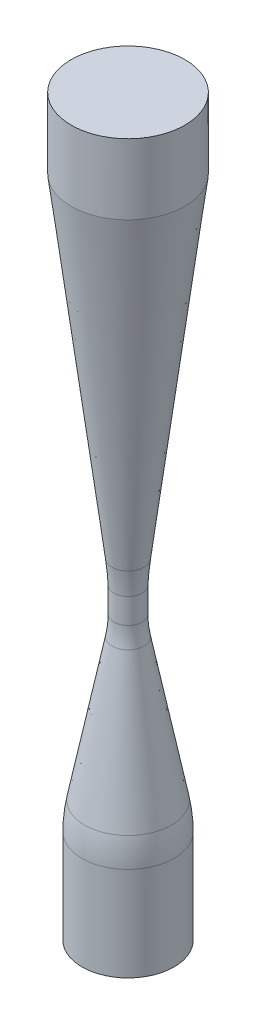
ISO-10303-21;
HEADER;
FILE_DESCRIPTION(('STEP AP214'),'2;1');
FILE_NAME('part.step','',(''),(''),'','','');
FILE_SCHEMA(('AUTOMOTIVE_DESIGN { 1 0 10303 214 1 1 1 1 }'));
ENDSEC;
DATA;
#1=APPLICATION_CONTEXT('core data for automotive mechanical design processes');
#2=APPLICATION_PROTOCOL_DEFINITION('international standard','automotive_design',2000,#1);
#3=PRODUCT_CONTEXT('',#1,'mechanical');
#4=PRODUCT('Part','Part','',(#3));
#5=PRODUCT_RELATED_PRODUCT_CATEGORY('part','',(#4));
#6=PRODUCT_DEFINITION_FORMATION('','',#4);
#7=PRODUCT_DEFINITION_CONTEXT('part definition',#1,'design');
#8=PRODUCT_DEFINITION('design','',#6,#7);
#9=PRODUCT_DEFINITION_SHAPE('','',#8);
#10=(LENGTH_UNIT() NAMED_UNIT(*) SI_UNIT(.MILLI.,.METRE.));
#11=(NAMED_UNIT(*) PLANE_ANGLE_UNIT() SI_UNIT($,.RADIAN.));
#12=(NAMED_UNIT(*) SI_UNIT($,.STERADIAN.) SOLID_ANGLE_UNIT());
#13=UNCERTAINTY_MEASURE_WITH_UNIT(LENGTH_MEASURE(1.E-05),#10,'distance_accuracy_value','');
#14=(GEOMETRIC_REPRESENTATION_CONTEXT(3) GLOBAL_UNCERTAINTY_ASSIGNED_CONTEXT((#13)) GLOBAL_UNIT_ASSIGNED_CONTEXT((#10,
#11,#12)) REPRESENTATION_CONTEXT('',''));
#15=CARTESIAN_POINT('',(0.,0.,0.));
#16=DIRECTION('',(0.,0.,1.));
#17=DIRECTION('',(1.,0.,0.));
#18=AXIS2_PLACEMENT_3D('',#15,#16,#17);
#19=CARTESIAN_POINT('',(-13.4821676,-85.34097524107,13.4821676));
#20=DIRECTION('',(0.,-1.,0.));
#21=DIRECTION('',(0.,0.,-1.));
#22=AXIS2_PLACEMENT_3D('',#19,#20,#21);
#23=PLANE('',#22);
#24=CARTESIAN_POINT('',(0.,-85.34097524107,0.));
#25=DIRECTION('',(0.,-1.,0.));
#26=DIRECTION('',(0.,0.,-1.));
#27=AXIS2_PLACEMENT_3D('',#24,#25,#26);
#28=CIRCLE('',#27,13.3222999999978);
#29=CARTESIAN_POINT('',(0.,-85.34097524107,-13.3222999999978));
#30=VERTEX_POINT('',#29);
#31=EDGE_CURVE('E37',#30,#30,#28,.T.);
#32=ORIENTED_EDGE('',*,*,#31,.T.);
#33=EDGE_LOOP('',(#32));
#34=FACE_BOUND('',#33,.T.);
#35=ADVANCED_FACE('F34',(#34),#23,.T.);
#36=CARTESIAN_POINT('',(0.,-58.16297524107,0.));
#37=DIRECTION('',(0.,-1.,0.));
#38=DIRECTION('',(0.,0.,-1.));
#39=AXIS2_PLACEMENT_3D('',#36,#37,#38);
#40=CYLINDRICAL_SURFACE('',#39,13.3222999999978);
#41=ORIENTED_EDGE('',*,*,#31,.F.);
#42=EDGE_LOOP('',(#41));
#43=FACE_BOUND('',#42,.T.);
#44=CARTESIAN_POINT('',(0.,-58.1629752410704,0.));
#45=DIRECTION('',(0.,-1.,0.));
#46=DIRECTION('',(0.707106781186547,0.,0.707106781186547));
#47=AXIS2_PLACEMENT_3D('',#44,#45,#46);
#48=CIRCLE('',#47,13.3223000000005);
#49=CARTESIAN_POINT('',(9.42028867100191,-58.1629752410704,9.42028867100191));
#50=VERTEX_POINT('',#49);
#51=EDGE_CURVE('E82',#50,#50,#48,.T.);
#52=ORIENTED_EDGE('',*,*,#51,.T.);
#53=EDGE_LOOP('',(#52));
#54=FACE_BOUND('',#53,.T.);
#55=ADVANCED_FACE('F88',(#43,#54),#40,.T.);
#56=CARTESIAN_POINT('',(-20.07760762268,-58.16297524107,-20.07760762268));
#57=DIRECTION('',(0.707106781186548,0.,-0.707106781186548));
#58=DIRECTION('',(0.481288982734709,0.732613015306429,0.481288982734709));
#59=AXIS2_PLACEMENT_3D('',#56,#57,#58);
#60=CIRCLE('',#59,41.716325);
#61=TRIMMED_CURVE('',#60,(PARAMETER_VALUE(0.)),(PARAMETER_VALUE(1.64430617346577)),.T.,.PARAMETER.);
#62=CARTESIAN_POINT('',(0.,-58.16297524107,0.));
#63=DIRECTION('',(0.,-1.,0.));
#64=AXIS1_PLACEMENT('',#62,#63);
#65=SURFACE_OF_REVOLUTION('',#61,#64);
#66=CARTESIAN_POINT('',(0.,-50.20312517702,0.));
#67=DIRECTION('',(0.,1.,0.));
#68=DIRECTION('',(0.707106781186548,0.,0.707106781186548));
#69=AXIS2_PLACEMENT_3D('',#66,#67,#68);
#70=CIRCLE('',#69,12.5558536135404);
#71=CARTESIAN_POINT('',(8.87832923372,-50.20312517702,8.87832923372));
#72=VERTEX_POINT('',#71);
#73=EDGE_CURVE('E78',#72,#72,#70,.F.);
#74=ORIENTED_EDGE('',*,*,#73,.T.);
#75=EDGE_LOOP('',(#74));
#76=FACE_BOUND('',#75,.T.);
#77=ORIENTED_EDGE('',*,*,#51,.F.);
#78=EDGE_LOOP('',(#77));
#79=FACE_BOUND('',#78,.T.);
#80=ADVANCED_FACE('F86',(#76,#79),#65,.T.);
#81=CARTESIAN_POINT('',(0.,-50.20312517702,0.));
#82=DIRECTION('',(0.,-1.,0.));
#83=DIRECTION('',(0.,0.,-1.));
#84=AXIS2_PLACEMENT_3D('',#81,#82,#83);
#85=CONICAL_SURFACE('',#84,12.5558536135404,0.191986217719547);
#86=ORIENTED_EDGE('',*,*,#73,.F.);
#87=EDGE_LOOP('',(#86));
#88=FACE_BOUND('',#87,.T.);
#89=CARTESIAN_POINT('',(0.,-9.34957752414624,0.));
#90=DIRECTION('',(0.,-1.,0.));
#91=DIRECTION('',(0.707106781186548,0.,0.707106781186548));
#92=AXIS2_PLACEMENT_3D('',#89,#90,#91);
#93=CIRCLE('',#92,4.61472839140541);
#94=CARTESIAN_POINT('',(3.26310573889686,-9.34957752414624,3.26310573889686));
#95=VERTEX_POINT('',#94);
#96=EDGE_CURVE('E74',#95,#95,#93,.T.);
#97=ORIENTED_EDGE('',*,*,#96,.T.);
#98=EDGE_LOOP('',(#97));
#99=FACE_BOUND('',#98,.T.);
#100=ADVANCED_FACE('F69',(#88,#99),#85,.T.);
#101=CARTESIAN_POINT('',(0.,-3.63004449616,0.));
#102=DIRECTION('',(0.,-1.,0.));
#103=DIRECTION('',(0.707106781186547,0.,0.707106781186547));
#104=AXIS2_PLACEMENT_3D('',#101,#102,#103);
#105=TOROIDAL_SURFACE('',#104,34.0391750000062,29.975175);
#106=CARTESIAN_POINT('',(0.,-3.63004449616,0.));
#107=DIRECTION('',(0.,-1.,0.));
#108=DIRECTION('',(0.707106781186547,0.,0.707106781186547));
#109=AXIS2_PLACEMENT_3D('',#106,#107,#108);
#110=CIRCLE('',#109,4.06399999999699);
#111=CARTESIAN_POINT('',(2.87368195874,-3.63004449616,2.87368195874));
#112=VERTEX_POINT('',#111);
#113=EDGE_CURVE('E77',#112,#112,#110,.T.);
#114=ORIENTED_EDGE('',*,*,#113,.T.);
#115=EDGE_LOOP('',(#114));
#116=FACE_BOUND('',#115,.T.);
#117=ORIENTED_EDGE('',*,*,#96,.F.);
#118=EDGE_LOOP('',(#117));
#119=FACE_BOUND('',#118,.T.);
#120=ADVANCED_FACE('F64',(#116,#119),#105,.F.);
#121=CARTESIAN_POINT('',(0.,3.63004449616,0.));
#122=DIRECTION('',(0.,-1.,0.));
#123=DIRECTION('',(0.,0.,-1.));
#124=AXIS2_PLACEMENT_3D('',#121,#122,#123);
#125=CYLINDRICAL_SURFACE('',#124,4.06399999999699);
#126=ORIENTED_EDGE('',*,*,#113,.F.);
#127=EDGE_LOOP('',(#126));
#128=FACE_BOUND('',#127,.T.);
#129=CARTESIAN_POINT('',(0.,3.63004449616481,0.));
#130=DIRECTION('',(0.,-1.,0.));
#131=DIRECTION('',(0.707106781186548,0.,0.707106781186548));
#132=AXIS2_PLACEMENT_3D('',#129,#130,#131);
#133=CIRCLE('',#132,4.06400000000755);
#134=CARTESIAN_POINT('',(2.87368195874747,3.63004449616481,2.87368195874747));
#135=VERTEX_POINT('',#134);
#136=EDGE_CURVE('E51',#135,#135,#133,.T.);
#137=ORIENTED_EDGE('',*,*,#136,.T.);
#138=EDGE_LOOP('',(#137));
#139=FACE_BOUND('',#138,.T.);
#140=ADVANCED_FACE('F59',(#128,#139),#125,.T.);
#141=CARTESIAN_POINT('',(0.,0.300729643,0.));
#142=DIRECTION('',(0.,-1.,0.));
#143=DIRECTION('',(0.707106781186548,0.,0.707106781186548));
#144=AXIS2_PLACEMENT_3D('',#141,#142,#143);
#145=TOROIDAL_SURFACE('',#144,86.8589610284853,82.86187246918);
#146=CARTESIAN_POINT('',(0.,10.39905163414,0.));
#147=DIRECTION('',(0.,-1.,0.));
#148=DIRECTION('',(0.707106781186548,0.,0.707106781186548));
#149=AXIS2_PLACEMENT_3D('',#146,#147,#148);
#150=CIRCLE('',#149,4.61472839139572);
#151=CARTESIAN_POINT('',(3.26310573889,10.39905163414,3.26310573889));
#152=VERTEX_POINT('',#151);
#153=EDGE_CURVE('E46',#152,#152,#150,.T.);
#154=ORIENTED_EDGE('',*,*,#153,.T.);
#155=EDGE_LOOP('',(#154));
#156=FACE_BOUND('',#155,.T.);
#157=ORIENTED_EDGE('',*,*,#136,.F.);
#158=EDGE_LOOP('',(#157));
#159=FACE_BOUND('',#158,.T.);
#160=ADVANCED_FACE('F54',(#156,#159),#145,.F.);
#161=CARTESIAN_POINT('',(-16.63378086813,127.,16.63378086813));
#162=DIRECTION('',(0.,-1.,0.));
#163=DIRECTION('',(0.,0.,-1.));
#164=AXIS2_PLACEMENT_3D('',#161,#162,#163);
#165=PLANE('',#164);
#166=CARTESIAN_POINT('',(0.,127.,0.));
#167=DIRECTION('',(0.,-1.,0.));
#168=DIRECTION('',(0.,0.,-1.));
#169=AXIS2_PLACEMENT_3D('',#166,#167,#168);
#170=CIRCLE('',#169,16.4365423598219);
#171=CARTESIAN_POINT('',(0.,127.,-16.4365423598219));
#172=VERTEX_POINT('',#171);
#173=EDGE_CURVE('E41',#172,#172,#170,.F.);
#174=ORIENTED_EDGE('',*,*,#173,.T.);
#175=EDGE_LOOP('',(#174));
#176=FACE_BOUND('',#175,.T.);
#177=ADVANCED_FACE('F58',(#176),#165,.F.);
#178=CARTESIAN_POINT('',(0.,106.68,0.));
#179=DIRECTION('',(0.,1.,0.));
#180=DIRECTION('',(0.,0.,1.));
#181=AXIS2_PLACEMENT_3D('',#178,#179,#180);
#182=CONICAL_SURFACE('',#181,16.4365423598219,0.122173047639693);
#183=CARTESIAN_POINT('',(0.,106.68,0.));
#184=DIRECTION('',(0.,-1.,0.));
#185=DIRECTION('',(0.707106781186548,0.,0.707106781186548));
#186=AXIS2_PLACEMENT_3D('',#183,#184,#185);
#187=CIRCLE('',#186,16.4365423598219);
#188=CARTESIAN_POINT('',(11.62239056189,106.68,11.62239056189));
#189=VERTEX_POINT('',#188);
#190=EDGE_CURVE('E10',#189,#189,#187,.T.);
#191=ORIENTED_EDGE('',*,*,#190,.T.);
#192=EDGE_LOOP('',(#191));
#193=FACE_BOUND('',#192,.T.);
#194=ORIENTED_EDGE('',*,*,#153,.F.);
#195=EDGE_LOOP('',(#194));
#196=FACE_BOUND('',#195,.T.);
#197=ADVANCED_FACE('F156',(#193,#196),#182,.T.);
#198=CARTESIAN_POINT('',(0.,127.,0.));
#199=DIRECTION('',(0.,-1.,0.));
#200=DIRECTION('',(0.,0.,-1.));
#201=AXIS2_PLACEMENT_3D('',#198,#199,#200);
#202=CYLINDRICAL_SURFACE('',#201,16.4365423598219);
#203=ORIENTED_EDGE('',*,*,#190,.F.);
#204=EDGE_LOOP('',(#203));
#205=FACE_BOUND('',#204,.T.);
#206=ORIENTED_EDGE('',*,*,#173,.F.);
#207=EDGE_LOOP('',(#206));
#208=FACE_BOUND('',#207,.T.);
#209=ADVANCED_FACE('F166',(#205,#208),#202,.T.);
#210=CLOSED_SHELL('',(#35,#55,#80,#100,#120,#140,#160,#177,#197,#209));
#211=MANIFOLD_SOLID_BREP('B2',#210);
#212=ADVANCED_BREP_SHAPE_REPRESENTATION('',(#18,#211),#14);
#213=SHAPE_DEFINITION_REPRESENTATION(#9,#212);
ENDSEC;
END-ISO-10303-21;
